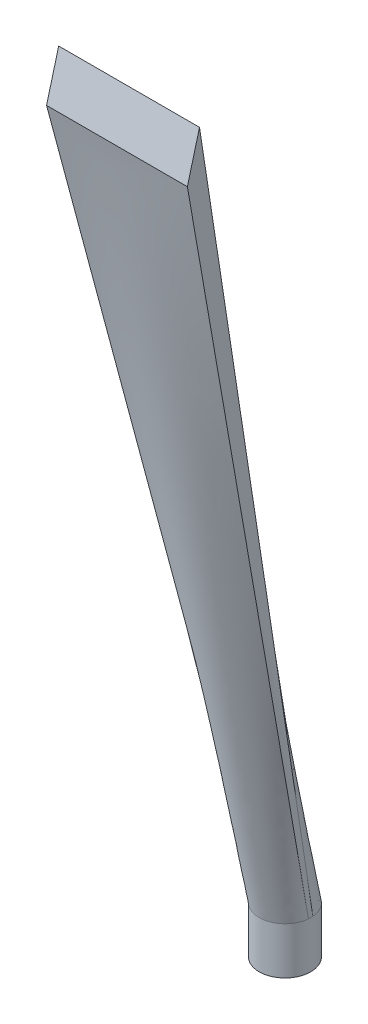
ISO-10303-21;
HEADER;
FILE_DESCRIPTION(('STEP AP214'),'2;1');
FILE_NAME('part.step','',(''),(''),'','','');
FILE_SCHEMA(('AUTOMOTIVE_DESIGN { 1 0 10303 214 1 1 1 1 }'));
ENDSEC;
DATA;
#1=APPLICATION_CONTEXT('core data for automotive mechanical design processes');
#2=APPLICATION_PROTOCOL_DEFINITION('international standard','automotive_design',2000,#1);
#3=PRODUCT_CONTEXT('',#1,'mechanical');
#4=PRODUCT('Part','Part','',(#3));
#5=PRODUCT_RELATED_PRODUCT_CATEGORY('part','',(#4));
#6=PRODUCT_DEFINITION_FORMATION('','',#4);
#7=PRODUCT_DEFINITION_CONTEXT('part definition',#1,'design');
#8=PRODUCT_DEFINITION('design','',#6,#7);
#9=PRODUCT_DEFINITION_SHAPE('','',#8);
#10=(LENGTH_UNIT() NAMED_UNIT(*) SI_UNIT(.MILLI.,.METRE.));
#11=(NAMED_UNIT(*) PLANE_ANGLE_UNIT() SI_UNIT($,.RADIAN.));
#12=(NAMED_UNIT(*) SI_UNIT($,.STERADIAN.) SOLID_ANGLE_UNIT());
#13=UNCERTAINTY_MEASURE_WITH_UNIT(LENGTH_MEASURE(1.E-05),#10,'distance_accuracy_value','');
#14=(GEOMETRIC_REPRESENTATION_CONTEXT(3) GLOBAL_UNCERTAINTY_ASSIGNED_CONTEXT((#13)) GLOBAL_UNIT_ASSIGNED_CONTEXT((#10,
#11,#12)) REPRESENTATION_CONTEXT('',''));
#15=CARTESIAN_POINT('',(0.,0.,0.));
#16=DIRECTION('',(0.,0.,1.));
#17=DIRECTION('',(1.,0.,0.));
#18=AXIS2_PLACEMENT_3D('',#15,#16,#17);
#19=CARTESIAN_POINT('',(0.,10.,0.));
#20=DIRECTION('',(0.,-1.,0.));
#21=DIRECTION('',(0.,0.,-1.));
#22=AXIS2_PLACEMENT_3D('',#19,#20,#21);
#23=CYLINDRICAL_SURFACE('',#22,5.5);
#24=CARTESIAN_POINT('',(0.,6.4,-5.5));
#25=CARTESIAN_POINT('',(-0.0773048842445591,6.39999791535494,-5.49999872545973));
#26=CARTESIAN_POINT('',(-0.154632790524441,6.39357557336227,-5.49835398423854));
#27=CARTESIAN_POINT('',(-0.307069339826278,6.36809622992761,-5.49195225148275));
#28=CARTESIAN_POINT('',(-0.382176752599211,6.34903235666165,-5.48719356725498));
#29=CARTESIAN_POINT('',(-0.527949238671479,6.29892358874975,-5.47509044111013));
#30=CARTESIAN_POINT('',(-0.598619629483061,6.26789336657137,-5.46774916678424));
#31=CARTESIAN_POINT('',(-0.733752228643042,6.19478510043921,-5.45126110120801));
#32=CARTESIAN_POINT('',(-0.798214172040278,6.15270658527472,-5.44211423295304));
#33=CARTESIAN_POINT('',(-0.920472473416103,6.05775000830458,-5.42278879332577));
#34=CARTESIAN_POINT('',(-0.978117819189877,6.00468084141597,-5.41259383960777));
#35=CARTESIAN_POINT('',(-1.08379364689064,5.88965838540526,-5.39242911774802));
#36=CARTESIAN_POINT('',(-1.13182300394015,5.82770405835117,-5.38245937607244));
#37=CARTESIAN_POINT('',(-1.21762063850407,5.69548863472367,-5.36370809078532));
#38=CARTESIAN_POINT('',(-1.25521870943935,5.62511387394251,-5.35494731115724));
#39=CARTESIAN_POINT('',(-1.31799146856049,5.47878348575326,-5.33984531832755));
#40=CARTESIAN_POINT('',(-1.34316822331491,5.40282878911198,-5.33350370268283));
#41=CARTESIAN_POINT('',(-1.37986602205555,5.2491583610413,-5.32412663932922));
#42=CARTESIAN_POINT('',(-1.39165920241181,5.17151172656839,-5.32102541066155));
#43=CARTESIAN_POINT('',(-1.40210295789717,5.01528493386204,-5.31828344958581));
#44=CARTESIAN_POINT('',(-1.4007557549539,4.93670493569682,-5.31864213213591));
#45=CARTESIAN_POINT('',(-1.38517382362171,4.78293786069106,-5.32272040476485));
#46=CARTESIAN_POINT('',(-1.37126470078388,4.70771518299115,-5.3263550762696));
#47=CARTESIAN_POINT('',(-1.33147372735175,4.56070776073046,-5.33644028895657));
#48=CARTESIAN_POINT('',(-1.30559099598359,4.48892326951006,-5.3428910372863));
#49=CARTESIAN_POINT('',(-1.24231330626715,4.34996333697399,-5.35795863283836));
#50=CARTESIAN_POINT('',(-1.20480125485013,4.28284368597169,-5.36659734039847));
#51=CARTESIAN_POINT('',(-1.1194115900729,4.15573559804708,-5.38505530705682));
#52=CARTESIAN_POINT('',(-1.07153210185643,4.09574845401707,-5.39487477954262));
#53=CARTESIAN_POINT('',(-0.965085886397212,3.98274374534973,-5.41494433468361));
#54=CARTESIAN_POINT('',(-0.906244742095388,3.929985071928,-5.42519855949331));
#55=CARTESIAN_POINT('',(-0.780426506291583,3.83503392147073,-5.44472048806602));
#56=CARTESIAN_POINT('',(-0.713449148092251,3.79284179093527,-5.45398815947206));
#57=CARTESIAN_POINT('',(-0.572881938789181,3.72012133629365,-5.47054168642758));
#58=CARTESIAN_POINT('',(-0.499268744723176,3.68963634208855,-5.4778201515144));
#59=CARTESIAN_POINT('',(-0.34773560315723,3.64154675976206,-5.48952153364639));
#60=CARTESIAN_POINT('',(-0.269816513933574,3.62393961464127,-5.49394501755027));
#61=CARTESIAN_POINT('',(-0.11409581038144,3.60250387238443,-5.49935365302411));
#62=CARTESIAN_POINT('',(-0.0363456876256445,3.59832287361052,-5.50042672290478));
#63=CARTESIAN_POINT('',(0.11874369704704,3.60288978751395,-5.49926466223468));
#64=CARTESIAN_POINT('',(0.19608299671977,3.61163649072017,-5.49702984115874));
#65=CARTESIAN_POINT('',(0.346921922039342,3.64152040671332,-5.48955956906865));
#66=CARTESIAN_POINT('',(0.42046239572951,3.66246421902601,-5.48437098196572));
#67=CARTESIAN_POINT('',(0.562981493503029,3.71592594785941,-5.47157891380273));
#68=CARTESIAN_POINT('',(0.631959646456293,3.74844505750246,-5.4639751838108));
#69=CARTESIAN_POINT('',(0.764789426404985,3.82480939317459,-5.44698690303916));
#70=CARTESIAN_POINT('',(0.828524522394591,3.86885048710791,-5.43757238521606));
#71=CARTESIAN_POINT('',(0.947824360643745,3.96675938020831,-5.41805217760614));
#72=CARTESIAN_POINT('',(1.0033876351497,4.02062894079807,-5.40794636413102));
#73=CARTESIAN_POINT('',(1.10622764496892,4.13830420158053,-5.38786418407469));
#74=CARTESIAN_POINT('',(1.15325677202767,4.20232835548851,-5.37789769964027));
#75=CARTESIAN_POINT('',(1.23590486774004,4.33756662802532,-5.3595091875876));
#76=CARTESIAN_POINT('',(1.2715243376448,4.40878043061638,-5.35108709212793));
#77=CARTESIAN_POINT('',(1.33007526262658,4.5559998996499,-5.33683503892478));
#78=CARTESIAN_POINT('',(1.35308171494095,4.63197418145127,-5.33098980077955));
#79=CARTESIAN_POINT('',(1.38594640154224,4.78688471815955,-5.3225413040893));
#80=CARTESIAN_POINT('',(1.39580763809809,4.86582029249359,-5.31993730527847));
#81=CARTESIAN_POINT('',(1.40194079646117,5.02188906453357,-5.31832400931396));
#82=CARTESIAN_POINT('',(1.39860904143414,5.09900584859978,-5.31920987108898));
#83=CARTESIAN_POINT('',(1.37936112086309,5.25153912341574,-5.3242332653694));
#84=CARTESIAN_POINT('',(1.36344522643773,5.32695565076063,-5.32837072782076));
#85=CARTESIAN_POINT('',(1.31970091487346,5.47349859660081,-5.33937162362339));
#86=CARTESIAN_POINT('',(1.29194940893323,5.54464938798325,-5.34621743690097));
#87=CARTESIAN_POINT('',(1.22538211014769,5.68133675534745,-5.36186558608171));
#88=CARTESIAN_POINT('',(1.18656472751624,5.74687252288257,-5.37066820307026));
#89=CARTESIAN_POINT('',(1.09773612733949,5.87237847220375,-5.38953489714849));
#90=CARTESIAN_POINT('',(1.04745111600293,5.93215074956052,-5.39962660429219));
#91=CARTESIAN_POINT('',(0.937644798813299,6.04253763332441,-5.41977237190905));
#92=CARTESIAN_POINT('',(0.87812129002087,6.09315004929192,-5.42982642281587));
#93=CARTESIAN_POINT('',(0.750165115842735,6.18471859288967,-5.44899174184822));
#94=CARTESIAN_POINT('',(0.681584890919074,6.22547337425833,-5.45808151269599));
#95=CARTESIAN_POINT('',(0.538320241252995,6.29481063340403,-5.4740651884717));
#96=CARTESIAN_POINT('',(0.463640113523221,6.32340159319865,-5.4809606226956));
#97=CARTESIAN_POINT('',(0.324275271985255,6.36349194568888,-5.49079310182131));
#98=CARTESIAN_POINT('',(0.260238280031033,6.37715229627942,-5.49422159263308));
#99=CARTESIAN_POINT('',(0.130806279374601,6.39540683792926,-5.49882548962657));
#100=CARTESIAN_POINT('',(0.0654113811916279,6.40000176391846,-5.50000107844983));
#101=CARTESIAN_POINT('',(0.,6.4,-5.5));
#102=B_SPLINE_CURVE_WITH_KNOTS('',3,(#24,#25,#26,#27,#28,#29,#30,#31,#32,#33,#34,#35,#36,#37,
#38,#39,#40,#41,#42,#43,#44,#45,#46,#47,#48,#49,#50,#51,#52,#53,#54,#55,#56,#57,#58,#59,#60,#61,
#62,#63,#64,#65,#66,#67,#68,#69,#70,#71,#72,#73,#74,#75,#76,#77,#78,#79,#80,#81,#82,#83,#84,#85,
#86,#87,#88,#89,#90,#91,#92,#93,#94,#95,#96,#97,#98,#99,#100,#101),.UNSPECIFIED.,.T.,.F.,(4,2,2,
2,2,2,2,2,2,2,2,2,2,2,2,2,2,2,2,2,2,2,2,2,2,2,2,2,2,2,2,2,2,2,2,2,2,2,4),(0.,0.23167489866669,
0.463475837097798,0.694993453271194,0.926520945296383,1.16247525755791,1.39845715562674,
1.63808915628129,1.87768127524435,2.11230906664584,2.3468971851611,2.57557396588813,
2.80426757066323,3.03534303563407,3.26646032344406,3.50441941512879,3.74238630899198,
3.98122565593394,4.22001756653907,4.45248828144497,4.68493724857071,4.91379709627019,
5.1426805405042,5.37574104384955,5.60884335656704,5.84789337265753,6.08693288531814,
6.32453520805198,6.56208325488996,6.79255020011164,7.02301218017953,7.25199883954841,
7.48101841302286,7.71621794363566,7.95147364448574,8.19119119169863,8.43074130515078,
8.62678847538596,8.82281975151176),.UNSPECIFIED.);
#103=CARTESIAN_POINT('',(0.,6.4,-5.5));
#104=VERTEX_POINT('',#103);
#105=EDGE_CURVE('E71',#104,#104,#102,.T.);
#106=ORIENTED_EDGE('',*,*,#105,.T.);
#107=EDGE_LOOP('',(#106));
#108=FACE_BOUND('',#107,.T.);
#109=CARTESIAN_POINT('',(5.47964521470163,10.,0.472745513989886));
#110=CARTESIAN_POINT('',(5.49318996142875,10.,0.315746865898593));
#111=CARTESIAN_POINT('',(5.49996233479231,10.,0.157873432949297));
#112=CARTESIAN_POINT('',(5.49996233479231,10.,-0.157873432949296));
#113=CARTESIAN_POINT('',(5.49318996142875,10.,-0.315746865898592));
#114=CARTESIAN_POINT('',(5.47964521470163,10.,-0.472745513989885));
#115=B_SPLINE_CURVE_WITH_KNOTS('',3,(#109,#110,#111,#112,#113,#114),.UNSPECIFIED.,.F.,.F.,(4,2,
4),(0.,0.5,1.),.UNSPECIFIED.);
#116=CARTESIAN_POINT('',(5.47967449872313,10.,0.472748031030865));
#117=VERTEX_POINT('',#116);
#118=CARTESIAN_POINT('',(5.47967779796221,10.,-0.472748324093858));
#119=VERTEX_POINT('',#118);
#120=EDGE_CURVE('E12',#117,#119,#115,.T.);
#121=ORIENTED_EDGE('',*,*,#120,.F.);
#122=CARTESIAN_POINT('',(-5.47964521478316,10.,0.472745513044765));
#123=CARTESIAN_POINT('',(-5.47632108142356,9.99999679978424,0.511275835108957));
#124=CARTESIAN_POINT('',(-5.47259067632118,9.99990886382516,0.549769679482633));
#125=CARTESIAN_POINT('',(-5.46431888878591,9.99963739751081,0.626669509199673));
#126=CARTESIAN_POINT('',(-5.45977751299709,9.99945386793869,0.665075495260228));
#127=CARTESIAN_POINT('',(-5.44493966088937,9.99887071817457,0.780136583030333));
#128=CARTESIAN_POINT('',(-5.43342914111034,9.99843852247503,0.856638507967667));
#129=CARTESIAN_POINT('',(-5.40719279582342,9.99780458544022,1.00908280574337));
#130=CARTESIAN_POINT('',(-5.39246716386582,9.99760283023695,1.08502521198049));
#131=CARTESIAN_POINT('',(-5.35982611754325,9.99751354351383,1.23622212308921));
#132=CARTESIAN_POINT('',(-5.3419107168077,9.99762601065138,1.31147663089864));
#133=CARTESIAN_POINT('',(-5.30293624796288,9.99808230723533,1.46110936398652));
#134=CARTESIAN_POINT('',(-5.28187937850245,9.99842597545456,1.53548816318468));
#135=CARTESIAN_POINT('',(-5.23664894745753,9.99914600729073,1.68329450359772));
#136=CARTESIAN_POINT('',(-5.21247538911876,9.99952237087362,1.75672204580317));
#137=CARTESIAN_POINT('',(-5.17391168447356,9.99987186129662,1.86604704442009));
#138=CARTESIAN_POINT('',(-5.16067271554014,9.99995251466656,1.90235392090914));
#139=CARTESIAN_POINT('',(-5.13343340544411,10.0000253321986,1.97467834229471));
#140=CARTESIAN_POINT('',(-5.11943311356991,10.0000175020823,2.01069590574862));
#141=CARTESIAN_POINT('',(-5.07629717169248,10.0000500761054,2.11829629679316));
#142=CARTESIAN_POINT('',(-5.04602619320225,10.0001465433141,2.18942756843401));
#143=CARTESIAN_POINT('',(-4.98249843954448,10.0002742989821,2.33038367669442));
#144=CARTESIAN_POINT('',(-4.94924024495362,10.0003055562831,2.40020787299056));
#145=CARTESIAN_POINT('',(-4.87981346103366,10.0003148878992,2.5383853725274));
#146=CARTESIAN_POINT('',(-4.84364500319879,10.0002929646159,2.60673874204769));
#147=CARTESIAN_POINT('',(-4.73086396016454,10.0001754553424,2.80941701868243));
#148=CARTESIAN_POINT('',(-4.64996368291905,10.0000281411765,2.94138676036774));
#149=CARTESIAN_POINT('',(-4.47736527077207,9.99991557765522,3.19798341706568));
#150=CARTESIAN_POINT('',(-4.38567177448987,9.99995025036428,3.32261345217458));
#151=CARTESIAN_POINT('',(-4.24050904734166,9.9999735269754,3.50343653570117));
#152=CARTESIAN_POINT('',(-4.19083311348158,9.99997649327304,3.56270942397397));
#153=CARTESIAN_POINT('',(-4.08902300374838,10.0000361527831,3.67911235496659));
#154=CARTESIAN_POINT('',(-4.03688880746521,10.0000928464417,3.73624237988791));
#155=CARTESIAN_POINT('',(-3.93025794028769,10.0001812543533,3.84825316693594));
#156=CARTESIAN_POINT('',(-3.8757612364364,10.0002129682577,3.90313389766424));
#157=CARTESIAN_POINT('',(-3.76450251193314,10.000217616479,4.01054854828686));
#158=CARTESIAN_POINT('',(-3.70774051008048,10.0001905512837,4.06308248764911));
#159=CARTESIAN_POINT('',(-3.59207870106269,10.0001076467033,4.16568652635452));
#160=CARTESIAN_POINT('',(-3.53317989280711,10.0000518206062,4.21575775181708));
#161=CARTESIAN_POINT('',(-3.41332280800014,9.99999917113495,4.31337469103312));
#162=CARTESIAN_POINT('',(-3.35236447994982,10.0000023492373,4.36092034155723));
#163=CARTESIAN_POINT('',(-3.22847266623812,10.0001088310788,4.45341925119608));
#164=CARTESIAN_POINT('',(-3.16553837696959,10.000212176079,4.49837143391585));
#165=CARTESIAN_POINT('',(-3.03783635493756,10.0003488209821,4.58557825416528));
#166=CARTESIAN_POINT('',(-2.97306879441268,10.0003821274431,4.6278331439035));
#167=CARTESIAN_POINT('',(-2.84180823601481,10.0003681531084,4.70957576440772));
#168=CARTESIAN_POINT('',(-2.77531519673171,10.0003208703767,4.74906342867825));
#169=CARTESIAN_POINT('',(-2.64072050364956,10.0001826176758,4.82520193698879));
#170=CARTESIAN_POINT('',(-2.57261877828242,10.0000916457594,4.86185265450583));
#171=CARTESIAN_POINT('',(-2.43493457836889,9.99999920108432,4.93224808932608));
#172=CARTESIAN_POINT('',(-2.36535219433418,9.99999772287051,4.96599298362753));
#173=CARTESIAN_POINT('',(-2.22482804962624,10.0001263730274,5.03051867434333));
#174=CARTESIAN_POINT('',(-2.15388630414312,10.0002564999283,5.06129950385631));
#175=CARTESIAN_POINT('',(-2.01076584571504,10.0004470088138,5.11984348063575));
#176=CARTESIAN_POINT('',(-1.93858712755366,10.0005073905042,5.1476066151727));
#177=CARTESIAN_POINT('',(-1.79313046051186,10.0005261267829,5.20006383971436));
#178=CARTESIAN_POINT('',(-1.71985250839089,10.0004844810703,5.22475792066947));
#179=CARTESIAN_POINT('',(-1.49855545049697,10.0002484541465,5.29416808506381));
#180=CARTESIAN_POINT('',(-1.34903279741705,9.99994302219855,5.33422858970762));
#181=CARTESIAN_POINT('',(-1.12268094645717,10.0000487818935,5.38475391729595));
#182=CARTESIAN_POINT('',(-1.04687718096714,10.0001780652513,5.40000261291051));
#183=CARTESIAN_POINT('',(-0.894686983255602,10.0004111168856,5.42729292181076));
#184=CARTESIAN_POINT('',(-0.818300550109251,10.0005148851217,5.43933453000486));
#185=CARTESIAN_POINT('',(-0.665087871173665,10.0006159772005,5.46018650496106));
#186=CARTESIAN_POINT('',(-0.588261614660053,10.0006132984366,5.46899679258892));
#187=CARTESIAN_POINT('',(-0.434305865244165,10.0005059748547,5.4833707938759));
#188=CARTESIAN_POINT('',(-0.357176373478369,10.0004013304185,5.48893451969099));
#189=CARTESIAN_POINT('',(-0.202752024686129,10.0001698609929,5.49680533654663));
#190=CARTESIAN_POINT('',(-0.12545716870314,10.0000430361432,5.49911244807621));
#191=CARTESIAN_POINT('',(0.0291625329465755,9.99998262541267,5.50046605944509));
#192=CARTESIAN_POINT('',(0.106487379099733,10.0000490428095,5.49951250397905));
#193=CARTESIAN_POINT('',(0.261030339366966,10.0002468685191,5.49434626929161));
#194=CARTESIAN_POINT('',(0.338248450130653,10.0003782788276,5.49013348999154));
#195=CARTESIAN_POINT('',(0.492433333318204,10.0005593501442,5.47845656409817));
#196=CARTESIAN_POINT('',(0.569400122365389,10.000609016673,5.47099263712376));
#197=CARTESIAN_POINT('',(0.722943337500415,10.0005953550904,5.4528275912485));
#198=CARTESIAN_POINT('',(0.799519799831031,10.0005320376688,5.44212677868061));
#199=CARTESIAN_POINT('',(0.952173061544569,10.0003279392039,5.41750360728579));
#200=CARTESIAN_POINT('',(1.02824972765972,10.000187138286,5.40358042244192));
#201=CARTESIAN_POINT('',(1.17973259713122,10.0000177005387,5.37254198098696));
#202=CARTESIAN_POINT('',(1.2551389380094,9.99998904014714,5.35542739572383));
#203=CARTESIAN_POINT('',(1.40517163762806,10.000079069043,5.31803257006204));
#204=CARTESIAN_POINT('',(1.47979790566529,10.0001977752775,5.29775196580747));
#205=CARTESIAN_POINT('',(1.62812892253155,10.0003948188098,5.25406260944803));
#206=CARTESIAN_POINT('',(1.70183367365883,10.0004731562083,5.23065386514639));
#207=CARTESIAN_POINT('',(1.84818273640836,10.0005337041884,5.18075254745355));
#208=CARTESIAN_POINT('',(1.92082716387727,10.0005159253512,5.15426031383347));
#209=CARTESIAN_POINT('',(2.06495008581217,10.0003849727012,5.09823107685491));
#210=CARTESIAN_POINT('',(2.13642832575367,10.0002717783401,5.06869341885174));
#211=CARTESIAN_POINT('',(2.27805772235552,10.000079549066,5.00663848294913));
#212=CARTESIAN_POINT('',(2.34820921452631,10.0000005054034,4.9741219708392));
#213=CARTESIAN_POINT('',(2.48708815282176,10.0000034575343,4.90615633341));
#214=CARTESIAN_POINT('',(2.55581541337022,10.0000854741821,4.87070682889144));
#215=CARTESIAN_POINT('',(2.6917140694425,10.0002387368557,4.79694202318275));
#216=CARTESIAN_POINT('',(2.75888547036451,10.0003099829187,4.75862673193767));
#217=CARTESIAN_POINT('',(2.89155419800347,10.0003840108679,4.67919778190737));
#218=CARTESIAN_POINT('',(2.95705150162634,10.0003867918101,4.63808408454693));
#219=CARTESIAN_POINT('',(3.08625339711822,10.0003061563537,4.55313269566294));
#220=CARTESIAN_POINT('',(3.14995801956846,10.0002227414264,4.509295050648));
#221=CARTESIAN_POINT('',(3.27546306890242,10.0000731797679,4.41897263327781));
#222=CARTESIAN_POINT('',(3.33726347952229,10.000007033184,4.37248783832292));
#223=CARTESIAN_POINT('',(3.45884986447758,9.99999443014489,4.2769539595914));
#224=CARTESIAN_POINT('',(3.5186358299138,10.0000479742183,4.22790486448891));
#225=CARTESIAN_POINT('',(3.63608416060515,10.0001429028947,4.12733192792407));
#226=CARTESIAN_POINT('',(3.69374662172397,10.0001842880473,4.07580819841941));
#227=CARTESIAN_POINT('',(3.80684784703988,10.0002228031358,3.97037615288328));
#228=CARTESIAN_POINT('',(3.86228661385904,10.0002199331239,3.91646783966374));
#229=CARTESIAN_POINT('',(3.97084284462793,10.0001525188698,3.80636084460762));
#230=CARTESIAN_POINT('',(4.02396032882185,10.0000879751655,3.75016218275371));
#231=CARTESIAN_POINT('',(4.12777487524444,10.0000140774806,3.63558173121919));
#232=CARTESIAN_POINT('',(4.17847193695013,10.0000047235119,3.57719994106689));
#233=CARTESIAN_POINT('',(4.32681598501275,9.99995912105342,3.39890461681422));
#234=CARTESIAN_POINT('',(4.42072749213865,9.99990533376509,3.27582930276119));
#235=CARTESIAN_POINT('',(4.553533947484,9.99995654612981,3.08566322932432));
#236=CARTESIAN_POINT('',(4.59646436542105,9.99999561281832,3.02134028019844));
#237=CARTESIAN_POINT('',(4.67957949240753,10.0000916397916,2.89093596061263));
#238=CARTESIAN_POINT('',(4.71976420891978,10.0001486000277,2.82485459493275));
#239=CARTESIAN_POINT('',(4.79730529237204,10.0002470120281,2.69106673403807));
#240=CARTESIAN_POINT('',(4.83466204118206,10.0002884658892,2.62336045987215));
#241=CARTESIAN_POINT('',(4.90648847935125,10.0003193087216,2.48643273910479));
#242=CARTESIAN_POINT('',(4.94095813874446,10.0003086971525,2.41721127678617));
#243=CARTESIAN_POINT('',(5.00694519183538,10.0002327265916,2.27738341558464));
#244=CARTESIAN_POINT('',(5.03846296184272,10.0001673745888,2.20677719462376));
#245=CARTESIAN_POINT('',(5.08348418410674,10.000065243795,2.09992445587947));
#246=CARTESIAN_POINT('',(5.09811548687545,10.0000305160335,2.06414928168602));
#247=CARTESIAN_POINT('',(5.12662074495777,10.0000050282885,1.9922985473187));
#248=CARTESIAN_POINT('',(5.14049470502788,10.0000142680289,1.95622298903302));
#249=CARTESIAN_POINT('',(5.17564080790401,9.99989683656268,1.86187787432744));
#250=CARTESIAN_POINT('',(5.19631176873768,9.99968457502079,1.80338291445589));
#251=CARTESIAN_POINT('',(5.23566133188262,9.99916665315106,1.68573405518732));
#252=CARTESIAN_POINT('',(5.25433998798084,9.99886099534552,1.62658017362709));
#253=CARTESIAN_POINT('',(5.3073531958664,9.99802717466736,1.44823250117271));
#254=CARTESIAN_POINT('',(5.33867697883244,9.99758194967861,1.32812048809131));
#255=CARTESIAN_POINT('',(5.37950107943261,9.99753353917306,1.14665276272477));
#256=CARTESIAN_POINT('',(5.39207897925917,9.99762050650957,1.08596759103763));
#257=CARTESIAN_POINT('',(5.41517775222457,9.99797054464012,0.964203606641484));
#258=CARTESIAN_POINT('',(5.42569862034607,9.9982336158637,0.903124792972714));
#259=CARTESIAN_POINT('',(5.44467154151399,9.99884930071134,0.780636634424086));
#260=CARTESIAN_POINT('',(5.4531232154659,9.99920193071928,0.719227231080328));
#261=CARTESIAN_POINT('',(5.46794646562669,9.99976526712189,0.596157511387007));
#262=CARTESIAN_POINT('',(5.4743180479698,9.99997597393511,0.534497195777932));
#263=CARTESIAN_POINT('',(5.47964521550487,10.,0.472745504679408));
#264=B_SPLINE_CURVE_WITH_KNOTS('',3,(#122,#123,#124,#125,#126,#127,#128,#129,#130,#131,#132,
#133,#134,#135,#136,#137,#138,#139,#140,#141,#142,#143,#144,#145,#146,#147,#148,#149,#150,#151,
#152,#153,#154,#155,#156,#157,#158,#159,#160,#161,#162,#163,#164,#165,#166,#167,#168,#169,#170,
#171,#172,#173,#174,#175,#176,#177,#178,#179,#180,#181,#182,#183,#184,#185,#186,#187,#188,#189,
#190,#191,#192,#193,#194,#195,#196,#197,#198,#199,#200,#201,#202,#203,#204,#205,#206,#207,#208,
#209,#210,#211,#212,#213,#214,#215,#216,#217,#218,#219,#220,#221,#222,#223,#224,#225,#226,#227,
#228,#229,#230,#231,#232,#233,#234,#235,#236,#237,#238,#239,#240,#241,#242,#243,#244,#245,#246,
#247,#248,#249,#250,#251,#252,#253,#254,#255,#256,#257,#258,#259,#260,#261,#262,#263),
.UNSPECIFIED.,.F.,.F.,(4,2,2,2,2,2,2,2,2,2,2,2,2,2,2,2,2,2,2,2,2,2,2,2,2,2,2,2,2,2,2,2,2,2,2,2,
2,2,2,2,2,2,2,2,2,2,2,2,2,2,2,2,2,2,2,2,2,2,2,2,2,2,2,2,2,2,2,2,2,2,4),(0.,0.116015419009212,
0.232029887577122,0.464047711519327,0.696051571799628,0.928054440786121,1.15989569096041,
1.3917366996961,1.50766535990971,1.62358652376066,1.85542648858687,2.08737720461893,
2.31931744631581,2.78311045857129,3.24670486854952,3.47865774618316,3.71061254997512,
3.94257059057422,4.17452670659484,4.40637575124072,4.63823059764088,4.87018099106614,
5.10210966426159,5.33404390871342,5.56598849108322,5.79791893533666,6.02984678940803,
6.26177562178045,6.49370513801569,6.95743379690003,7.18934946183052,7.42126549495029,
7.65318720725705,7.88510805118286,8.11702743596972,8.34895075444449,8.58088119470688,
8.81279597022097,9.0446888046055,9.27664114793758,9.50854475234704,9.74047502801326,
9.97240472513458,10.2043088899665,10.4362630092848,10.6681576653929,10.9000823495736,
11.1320062289504,11.3639333059793,11.5958564241798,11.8277815226849,12.0597076456295,
12.2916232856112,12.5235386521217,12.7554519956673,12.9873653893222,13.4511425084445,
13.6830915056635,13.9150398724207,14.1469568623316,14.3788762590792,14.6107660501668,
14.7267132492754,14.8426597200911,15.0287398033567,15.2148148616808,15.5868621095767,
15.7727603704993,15.9586590848435,16.1445918320177,16.3305240308673),.UNSPECIFIED.);
#265=CARTESIAN_POINT('',(-5.47967779796221,10.,0.472748324093855));
#266=VERTEX_POINT('',#265);
#267=EDGE_CURVE('E87',#266,#117,#264,.T.);
#268=ORIENTED_EDGE('',*,*,#267,.F.);
#269=CARTESIAN_POINT('',(0.,10.,0.));
#270=DIRECTION('',(0.,1.,0.));
#271=DIRECTION('',(0.,0.,1.));
#272=AXIS2_PLACEMENT_3D('',#269,#270,#271);
#273=CIRCLE('',#272,5.5);
#274=CARTESIAN_POINT('',(-5.47967449872313,10.,-0.472748031030872));
#275=VERTEX_POINT('',#274);
#276=EDGE_CURVE('E91',#275,#266,#273,.T.);
#277=ORIENTED_EDGE('',*,*,#276,.F.);
#278=EDGE_CURVE('E111',#119,#275,#273,.T.);
#279=ORIENTED_EDGE('',*,*,#278,.F.);
#280=EDGE_LOOP('',(#121,#268,#277,#279));
#281=FACE_BOUND('',#280,.T.);
#282=CARTESIAN_POINT('',(0.,0.,0.));
#283=DIRECTION('',(0.,1.,0.));
#284=DIRECTION('',(0.,0.,1.));
#285=AXIS2_PLACEMENT_3D('',#282,#283,#284);
#286=CIRCLE('',#285,5.5);
#287=CARTESIAN_POINT('',(0.,0.,5.5));
#288=VERTEX_POINT('',#287);
#289=EDGE_CURVE('E80',#288,#288,#286,.T.);
#290=ORIENTED_EDGE('',*,*,#289,.T.);
#291=EDGE_LOOP('',(#290));
#292=FACE_BOUND('',#291,.T.);
#293=ADVANCED_FACE('F67',(#108,#281,#292),#23,.T.);
#294=CARTESIAN_POINT('',(0.,0.,0.));
#295=DIRECTION('',(0.,1.,0.));
#296=DIRECTION('',(0.,0.,1.));
#297=AXIS2_PLACEMENT_3D('',#294,#295,#296);
#298=PLANE('',#297);
#299=ORIENTED_EDGE('',*,*,#289,.F.);
#300=EDGE_LOOP('',(#299));
#301=FACE_BOUND('',#300,.T.);
#302=ADVANCED_FACE('F218',(#301),#298,.F.);
#303=CARTESIAN_POINT('',(0.,20.1695909558946,75.2739382152813));
#304=DIRECTION('',(0.,0.258819045102518,0.965925826289069));
#305=DIRECTION('',(0.,-0.965925826289069,0.258819045102518));
#306=AXIS2_PLACEMENT_3D('',#303,#304,#305);
#307=PLANE('',#306);
#308=DIRECTION('',(-1.,0.,0.));
#309=VECTOR('',#308,1.);
#310=CARTESIAN_POINT('',(-15.,177.169629131445,33.2059047744875));
#311=LINE('',#310,#309);
#312=CARTESIAN_POINT('',(15.,177.169629131445,33.2059047744875));
#313=VERTEX_POINT('',#312);
#314=CARTESIAN_POINT('',(-15.,177.169629131445,33.2059047744875));
#315=VERTEX_POINT('',#314);
#316=EDGE_CURVE('E135',#313,#315,#311,.T.);
#317=ORIENTED_EDGE('',*,*,#316,.T.);
#318=DIRECTION('',(0.,-0.965925826289069,0.258819045102518));
#319=VECTOR('',#318,1.);
#320=CARTESIAN_POINT('',(-15.,167.510370868555,35.7940952255127));
#321=LINE('',#320,#319);
#322=CARTESIAN_POINT('',(-15.,167.510370868555,35.7940952255127));
#323=VERTEX_POINT('',#322);
#324=EDGE_CURVE('E152',#315,#323,#321,.T.);
#325=ORIENTED_EDGE('',*,*,#324,.T.);
#326=DIRECTION('',(1.,0.,0.));
#327=VECTOR('',#326,1.);
#328=CARTESIAN_POINT('',(-15.,167.510370868555,35.7940952255127));
#329=LINE('',#328,#327);
#330=CARTESIAN_POINT('',(15.,167.510370868555,35.7940952255127));
#331=VERTEX_POINT('',#330);
#332=EDGE_CURVE('E200',#323,#331,#329,.T.);
#333=ORIENTED_EDGE('',*,*,#332,.T.);
#334=DIRECTION('',(0.,0.965925826289069,-0.258819045102518));
#335=VECTOR('',#334,1.);
#336=CARTESIAN_POINT('',(15.,167.510370868555,35.7940952255127));
#337=LINE('',#336,#335);
#338=EDGE_CURVE('E131',#331,#313,#337,.T.);
#339=ORIENTED_EDGE('',*,*,#338,.T.);
#340=EDGE_LOOP('',(#317,#325,#333,#339));
#341=FACE_BOUND('',#340,.T.);
#342=ADVANCED_FACE('F169',(#341),#307,.T.);
#343=CARTESIAN_POINT('',(-5.47964521470163,10.,-0.472745513989888));
#344=CARTESIAN_POINT('',(-15.,177.169629131445,33.2059047744875));
#345=CARTESIAN_POINT('',(-5.49318996142875,10.,-0.315746865898594));
#346=CARTESIAN_POINT('',(-15.,175.559752754297,33.6372698496584));
#347=CARTESIAN_POINT('',(-5.49996233479231,10.,-0.157873432949298));
#348=CARTESIAN_POINT('',(-15.,173.949876377148,34.0686349248292));
#349=CARTESIAN_POINT('',(-5.49996233479231,10.,0.157873432949296));
#350=CARTESIAN_POINT('',(-15.,170.730123622851,34.931365075171));
#351=CARTESIAN_POINT('',(-5.49318996142875,10.,0.315746865898592));
#352=CARTESIAN_POINT('',(-15.,169.120247245703,35.3627301503418));
#353=CARTESIAN_POINT('',(-5.47964521470163,10.,0.472745513989886));
#354=CARTESIAN_POINT('',(-15.,167.510370868555,35.7940952255127));
#355=B_SPLINE_SURFACE_WITH_KNOTS('',3,1,((#343,#344),(#345,#346),(#347,#348),(#349,#350),(#351,
#352),(#353,#354)),.UNSPECIFIED.,.F.,.F.,.F.,(4,2,4),(2,2),(0.,0.5,1.),(0.,1.),.UNSPECIFIED.);
#356=DIRECTION('',(-0.0588756826728951,0.974074057331091,0.218433936979461));
#357=VECTOR('',#356,1.);
#358=CARTESIAN_POINT('',(-10.2398226073508,88.7551854342774,18.1334203697513));
#359=LINE('',#358,#357);
#360=EDGE_CURVE('E127',#266,#323,#359,.T.);
#361=DIRECTION('',(0.0557417563950411,-0.978779567971988,-0.197188777354504));
#362=VECTOR('',#361,1.);
#363=CARTESIAN_POINT('',(-10.2398226073508,93.5848145657227,16.3665796302488));
#364=LINE('',#363,#362);
#365=EDGE_CURVE('E137',#315,#275,#364,.T.);
#366=ORIENTED_EDGE('',*,*,#276,.T.);
#367=ORIENTED_EDGE('',*,*,#360,.T.);
#368=ORIENTED_EDGE('',*,*,#324,.F.);
#369=ORIENTED_EDGE('',*,*,#365,.T.);
#370=EDGE_LOOP('',(#366,#367,#368,#369));
#371=FACE_BOUND('',#370,.T.);
#372=ADVANCED_FACE('F158',(#371),#355,.T.);
#373=CARTESIAN_POINT('',(-5.38444166684864,8.42489629131445,0.119532016874658));
#374=CARTESIAN_POINT('',(-5.47964521470163,10.,0.472745513989886));
#375=CARTESIAN_POINT('',(-15.,167.510370868555,35.7940952255127));
#376=CARTESIAN_POINT('',(-5.35729950820559,8.42489629131445,0.579028634992725));
#377=CARTESIAN_POINT('',(-5.4403955526788,10.,0.927692660641438));
#378=CARTESIAN_POINT('',(-13.75,167.510370868555,35.7940952255127));
#379=CARTESIAN_POINT('',(-5.26920161214688,8.42489629131445,1.08875449092422));
#380=CARTESIAN_POINT('',(-5.34079367539296,10.,1.43237172592015));
#381=CARTESIAN_POINT('',(-12.5,167.510370868555,35.7940952255127));
#382=CARTESIAN_POINT('',(-4.88219713927357,8.42489629131445,2.16555868182811));
#383=CARTESIAN_POINT('',(-4.9328684547263,10.,2.49851448919133));
#384=CARTESIAN_POINT('',(-9.99999999999999,167.510370868555,35.7940952255127));
#385=CARTESIAN_POINT('',(-4.58066375582554,8.42489629131445,2.73377456527267));
#386=CARTESIAN_POINT('',(-4.62194431269855,10.,3.0611044727998));
#387=CARTESIAN_POINT('',(-8.75,167.510370868555,35.7940952255127));
#388=CARTESIAN_POINT('',(-3.91278749745754,8.42489629131445,3.53159530923812));
#389=CARTESIAN_POINT('',(-3.94211633411638,10.,3.85102600147846));
#390=CARTESIAN_POINT('',(-6.875,167.510370868555,35.7940952255127));
#391=CARTESIAN_POINT('',(-3.65461969674808,8.42489629131445,3.78756944202117));
#392=CARTESIAN_POINT('',(-3.68031653143374,10.,4.10446573690723));
#393=CARTESIAN_POINT('',(-6.25,167.510370868555,35.7940952255127));
#394=CARTESIAN_POINT('',(-3.06838519738734,8.42489629131445,4.2548574423987));
#395=CARTESIAN_POINT('',(-3.0875100964231,10.,4.56712712341963));
#396=CARTESIAN_POINT('',(-5.,167.510370868555,35.7940952255127));
#397=CARTESIAN_POINT('',(-2.74023762724199,8.42489629131445,4.46598162063134));
#398=CARTESIAN_POINT('',(-2.7564233933089,10.,4.77616096325393));
#399=CARTESIAN_POINT('',(-4.375,167.510370868555,35.7940952255127));
#400=CARTESIAN_POINT('',(-2.02644783228287,8.42489629131445,4.81764555835973));
#401=CARTESIAN_POINT('',(-2.03732458641868,10.,5.12434307981669));
#402=CARTESIAN_POINT('',(-3.12499999999999,167.510370868555,35.7940952255127));
#403=CARTESIAN_POINT('',(-1.64086148429062,8.42489629131445,4.95794537744344));
#404=CARTESIAN_POINT('',(-1.64936780622834,10.,5.26325379178076));
#405=CARTESIAN_POINT('',(-2.49999999999999,167.510370868555,35.7940952255127));
#406=CARTESIAN_POINT('',(-0.83675489160254,8.42489629131446,5.1477386683011));
#407=CARTESIAN_POINT('',(-0.840846427329248,10.,5.45116794114478));
#408=CARTESIAN_POINT('',(-1.25,167.510370868555,35.7940952255127));
#409=CARTESIAN_POINT('',(-0.41844900841483,8.42489629131445,5.19705904774487));
#410=CARTESIAN_POINT('',(-0.420494067737456,10.,5.5));
#411=CARTESIAN_POINT('',(-0.624999999999998,167.510370868555,35.7940952255127));
#412=CARTESIAN_POINT('',(0.418449008414829,8.42489629131445,5.19705904774487));
#413=CARTESIAN_POINT('',(0.420494067737455,10.,5.5));
#414=CARTESIAN_POINT('',(0.625000000000002,167.510370868555,35.7940952255127));
#415=CARTESIAN_POINT('',(0.836754891602539,8.42489629131446,5.1477386683011));
#416=CARTESIAN_POINT('',(0.840846427329247,10.,5.45116794114478));
#417=CARTESIAN_POINT('',(1.25,167.510370868555,35.7940952255127));
#418=CARTESIAN_POINT('',(1.64086148429062,8.42489629131446,4.95794537744344));
#419=CARTESIAN_POINT('',(1.64936780622833,10.,5.26325379178076));
#420=CARTESIAN_POINT('',(2.50000000000001,167.510370868555,35.7940952255127));
#421=CARTESIAN_POINT('',(2.02644783228287,8.42489629131445,4.81764555835973));
#422=CARTESIAN_POINT('',(2.03732458641868,10.,5.12434307981669));
#423=CARTESIAN_POINT('',(3.12500000000001,167.510370868555,35.7940952255127));
#424=CARTESIAN_POINT('',(2.74023762724199,8.42489629131445,4.46598162063134));
#425=CARTESIAN_POINT('',(2.7564233933089,10.,4.77616096325393));
#426=CARTESIAN_POINT('',(4.37500000000001,167.510370868555,35.7940952255127));
#427=CARTESIAN_POINT('',(3.06838519738733,8.42489629131445,4.2548574423987));
#428=CARTESIAN_POINT('',(3.0875100964231,10.,4.56712712341963));
#429=CARTESIAN_POINT('',(5.00000000000001,167.510370868555,35.7940952255127));
#430=CARTESIAN_POINT('',(3.65461969674808,8.42489629131445,3.78756944202117));
#431=CARTESIAN_POINT('',(3.68031653143374,10.,4.10446573690723));
#432=CARTESIAN_POINT('',(6.25000000000001,167.510370868555,35.7940952255127));
#433=CARTESIAN_POINT('',(3.91278749745754,8.42489629131445,3.53159530923812));
#434=CARTESIAN_POINT('',(3.94211633411637,10.,3.85102600147847));
#435=CARTESIAN_POINT('',(6.87500000000001,167.510370868555,35.7940952255127));
#436=CARTESIAN_POINT('',(4.58066375582553,8.42489629131445,2.73377456527267));
#437=CARTESIAN_POINT('',(4.62194431269855,10.,3.0611044727998));
#438=CARTESIAN_POINT('',(8.75000000000001,167.510370868555,35.7940952255127));
#439=CARTESIAN_POINT('',(4.88219713927356,8.42489629131445,2.16555868182811));
#440=CARTESIAN_POINT('',(4.9328684547263,10.,2.49851448919133));
#441=CARTESIAN_POINT('',(10.,167.510370868555,35.7940952255127));
#442=CARTESIAN_POINT('',(5.26920161214689,8.42489629131445,1.08875449092423));
#443=CARTESIAN_POINT('',(5.34079367539296,10.,1.43237172592015));
#444=CARTESIAN_POINT('',(12.5,167.510370868555,35.7940952255127));
#445=CARTESIAN_POINT('',(5.35729950820559,8.42489629131445,0.579028634992727));
#446=CARTESIAN_POINT('',(5.44039555267881,10.,0.927692660641439));
#447=CARTESIAN_POINT('',(13.75,167.510370868555,35.7940952255127));
#448=CARTESIAN_POINT('',(5.38444166684864,8.42489629131445,0.119532016874659));
#449=CARTESIAN_POINT('',(5.47964521470163,10.,0.472745513989887));
#450=CARTESIAN_POINT('',(15.,167.510370868555,35.7940952255127));
#451=B_SPLINE_SURFACE_WITH_KNOTS('',3,1,((#373,#374,#375),(#376,#377,#378),(#379,#380,#381),
(#382,#383,#384),(#385,#386,#387),(#388,#389,#390),(#391,#392,#393),(#394,#395,#396),(#397,#398,
#399),(#400,#401,#402),(#403,#404,#405),(#406,#407,#408),(#409,#410,#411),(#412,#413,#414),
(#415,#416,#417),(#418,#419,#420),(#421,#422,#423),(#424,#425,#426),(#427,#428,#429),(#430,#431,
#432),(#433,#434,#435),(#436,#437,#438),(#439,#440,#441),(#442,#443,#444),(#445,#446,#447),
(#448,#449,#450)),.UNSPECIFIED.,.F.,.F.,.F.,(4,2,2,2,2,2,2,2,2,2,2,2,4),(2,1,2),(0.,0.125,0.25,
0.3125,0.375,0.4375,0.5,0.5625,0.625,0.6875,0.75,0.875,1.),(-0.01,0.,1.),.UNSPECIFIED.);
#452=DIRECTION('',(0.0588756826728952,0.974074057331091,0.218433936979461));
#453=VECTOR('',#452,1.);
#454=CARTESIAN_POINT('',(10.2398226073508,88.7551854342774,18.1334203697513));
#455=LINE('',#454,#453);
#456=EDGE_CURVE('E125',#117,#331,#455,.T.);
#457=ORIENTED_EDGE('',*,*,#267,.T.);
#458=ORIENTED_EDGE('',*,*,#456,.T.);
#459=ORIENTED_EDGE('',*,*,#332,.F.);
#460=ORIENTED_EDGE('',*,*,#360,.F.);
#461=EDGE_LOOP('',(#457,#458,#459,#460));
#462=FACE_BOUND('',#461,.T.);
#463=ADVANCED_FACE('F123',(#462),#451,.T.);
#464=CARTESIAN_POINT('',(5.47964521470163,10.,-0.472745513989885));
#465=CARTESIAN_POINT('',(15.,177.169629131445,33.2059047744875));
#466=CARTESIAN_POINT('',(5.4403955526788,10.,-0.927692660641437));
#467=CARTESIAN_POINT('',(13.75,177.169629131445,33.2059047744875));
#468=CARTESIAN_POINT('',(5.34079367539296,10.,-1.43237172592015));
#469=CARTESIAN_POINT('',(12.5,177.169629131445,33.2059047744875));
#470=CARTESIAN_POINT('',(4.9328684547263,10.,-2.49851448919133));
#471=CARTESIAN_POINT('',(10.,177.169629131445,33.2059047744875));
#472=CARTESIAN_POINT('',(4.62194431269855,10.,-3.0611044727998));
#473=CARTESIAN_POINT('',(8.75000000000001,177.169629131445,33.2059047744875));
#474=CARTESIAN_POINT('',(3.94211633411638,10.,-3.85102600147846));
#475=CARTESIAN_POINT('',(6.87500000000001,177.169629131445,33.2059047744875));
#476=CARTESIAN_POINT('',(3.68031653143374,10.,-4.10446573690723));
#477=CARTESIAN_POINT('',(6.25000000000001,177.169629131445,33.2059047744875));
#478=CARTESIAN_POINT('',(3.0875100964231,10.,-4.56712712341963));
#479=CARTESIAN_POINT('',(5.00000000000001,177.169629131445,33.2059047744875));
#480=CARTESIAN_POINT('',(2.7564233933089,10.,-4.77616096325393));
#481=CARTESIAN_POINT('',(4.37500000000001,177.169629131445,33.2059047744875));
#482=CARTESIAN_POINT('',(2.03732458641868,10.,-5.12434307981669));
#483=CARTESIAN_POINT('',(3.12500000000001,177.169629131445,33.2059047744875));
#484=CARTESIAN_POINT('',(1.64936780622834,10.,-5.26325379178076));
#485=CARTESIAN_POINT('',(2.50000000000001,177.169629131445,33.2059047744875));
#486=CARTESIAN_POINT('',(0.840846427329247,10.,-5.45116794114478));
#487=CARTESIAN_POINT('',(1.25000000000001,177.169629131445,33.2059047744875));
#488=CARTESIAN_POINT('',(0.420494067737457,10.,-5.5));
#489=CARTESIAN_POINT('',(0.625000000000014,177.169629131445,33.2059047744875));
#490=CARTESIAN_POINT('',(-0.420494067737454,10.,-5.5));
#491=CARTESIAN_POINT('',(-0.624999999999986,177.169629131445,33.2059047744875));
#492=CARTESIAN_POINT('',(-0.840846427329245,10.,-5.45116794114478));
#493=CARTESIAN_POINT('',(-1.24999999999999,177.169629131445,33.2059047744875));
#494=CARTESIAN_POINT('',(-1.64936780622833,10.,-5.26325379178076));
#495=CARTESIAN_POINT('',(-2.49999999999999,177.169629131445,33.2059047744875));
#496=CARTESIAN_POINT('',(-2.03732458641868,10.,-5.12434307981669));
#497=CARTESIAN_POINT('',(-3.12499999999999,177.169629131445,33.2059047744875));
#498=CARTESIAN_POINT('',(-2.7564233933089,10.,-4.77616096325393));
#499=CARTESIAN_POINT('',(-4.37499999999999,177.169629131445,33.2059047744875));
#500=CARTESIAN_POINT('',(-3.0875100964231,10.,-4.56712712341963));
#501=CARTESIAN_POINT('',(-4.99999999999999,177.169629131445,33.2059047744875));
#502=CARTESIAN_POINT('',(-3.68031653143374,10.,-4.10446573690723));
#503=CARTESIAN_POINT('',(-6.24999999999999,177.169629131445,33.2059047744875));
#504=CARTESIAN_POINT('',(-3.94211633411637,10.,-3.85102600147846));
#505=CARTESIAN_POINT('',(-6.87499999999999,177.169629131445,33.2059047744875));
#506=CARTESIAN_POINT('',(-4.62194431269855,10.,-3.0611044727998));
#507=CARTESIAN_POINT('',(-8.74999999999999,177.169629131445,33.2059047744875));
#508=CARTESIAN_POINT('',(-4.9328684547263,10.,-2.49851448919133));
#509=CARTESIAN_POINT('',(-9.99999999999999,177.169629131445,33.2059047744875));
#510=CARTESIAN_POINT('',(-5.34079367539296,10.,-1.43237172592015));
#511=CARTESIAN_POINT('',(-12.5,177.169629131445,33.2059047744875));
#512=CARTESIAN_POINT('',(-5.4403955526788,10.,-0.92769266064144));
#513=CARTESIAN_POINT('',(-13.75,177.169629131445,33.2059047744875));
#514=CARTESIAN_POINT('',(-5.47964521470163,10.,-0.472745513989888));
#515=CARTESIAN_POINT('',(-15.,177.169629131445,33.2059047744875));
#516=B_SPLINE_SURFACE_WITH_KNOTS('',3,1,((#464,#465),(#466,#467),(#468,#469),(#470,#471),(#472,
#473),(#474,#475),(#476,#477),(#478,#479),(#480,#481),(#482,#483),(#484,#485),(#486,#487),(#488,
#489),(#490,#491),(#492,#493),(#494,#495),(#496,#497),(#498,#499),(#500,#501),(#502,#503),(#504,
#505),(#506,#507),(#508,#509),(#510,#511),(#512,#513),(#514,#515)),.UNSPECIFIED.,.F.,.F.,.F.,(4,
2,2,2,2,2,2,2,2,2,2,2,4),(2,2),(0.,0.125,0.25,0.3125,0.375,0.4375,0.5,0.5625,0.625,0.6875,0.75,
0.875,1.),(0.,1.),.UNSPECIFIED.);
#517=DIRECTION('',(0.0557417563950411,0.978779567971988,0.197188777354504));
#518=VECTOR('',#517,1.);
#519=CARTESIAN_POINT('',(10.2398226073508,93.5848145657227,16.3665796302488));
#520=LINE('',#519,#518);
#521=EDGE_CURVE('E133',#119,#313,#520,.T.);
#522=ORIENTED_EDGE('',*,*,#278,.T.);
#523=ORIENTED_EDGE('',*,*,#365,.F.);
#524=ORIENTED_EDGE('',*,*,#316,.F.);
#525=ORIENTED_EDGE('',*,*,#521,.F.);
#526=EDGE_LOOP('',(#522,#523,#524,#525));
#527=FACE_BOUND('',#526,.T.);
#528=ADVANCED_FACE('F309',(#527),#516,.T.);
#529=CARTESIAN_POINT('',(5.47964521470163,10.,0.472745513989886));
#530=CARTESIAN_POINT('',(15.,167.510370868555,35.7940952255127));
#531=CARTESIAN_POINT('',(5.49318996142875,10.,0.315746865898593));
#532=CARTESIAN_POINT('',(15.,169.120247245703,35.3627301503418));
#533=CARTESIAN_POINT('',(5.49996233479231,10.,0.157873432949297));
#534=CARTESIAN_POINT('',(15.,170.730123622852,34.9313650751709));
#535=CARTESIAN_POINT('',(5.49996233479231,10.,-0.157873432949296));
#536=CARTESIAN_POINT('',(15.,173.949876377148,34.0686349248292));
#537=CARTESIAN_POINT('',(5.49318996142875,10.,-0.315746865898592));
#538=CARTESIAN_POINT('',(15.,175.559752754297,33.6372698496583));
#539=CARTESIAN_POINT('',(5.47964521470163,10.,-0.472745513989885));
#540=CARTESIAN_POINT('',(15.,177.169629131445,33.2059047744875));
#541=B_SPLINE_SURFACE_WITH_KNOTS('',3,1,((#529,#530),(#531,#532),(#533,#534),(#535,#536),(#537,
#538),(#539,#540)),.UNSPECIFIED.,.F.,.F.,.F.,(4,2,4),(2,2),(0.,0.5,1.),(0.,1.),.UNSPECIFIED.);
#542=ORIENTED_EDGE('',*,*,#120,.T.);
#543=ORIENTED_EDGE('',*,*,#521,.T.);
#544=ORIENTED_EDGE('',*,*,#338,.F.);
#545=ORIENTED_EDGE('',*,*,#456,.F.);
#546=EDGE_LOOP('',(#542,#543,#544,#545));
#547=FACE_BOUND('',#546,.T.);
#548=ADVANCED_FACE('F130',(#547),#541,.T.);
#549=CARTESIAN_POINT('',(0.,5.,-5.50922558303823));
#550=DIRECTION('',(0.,0.,1.));
#551=DIRECTION('',(1.,0.,0.));
#552=AXIS2_PLACEMENT_3D('',#549,#550,#551);
#553=CYLINDRICAL_SURFACE('',#552,1.4);
#554=CARTESIAN_POINT('',(0.,5.,-1.));
#555=DIRECTION('',(0.,0.,1.));
#556=DIRECTION('',(1.,0.,0.));
#557=AXIS2_PLACEMENT_3D('',#554,#555,#556);
#558=CIRCLE('',#557,1.4);
#559=CARTESIAN_POINT('',(1.4,5.,-1.));
#560=VERTEX_POINT('',#559);
#561=EDGE_CURVE('E263',#560,#560,#558,.T.);
#562=ORIENTED_EDGE('',*,*,#561,.T.);
#563=EDGE_LOOP('',(#562));
#564=FACE_BOUND('',#563,.T.);
#565=ORIENTED_EDGE('',*,*,#105,.F.);
#566=EDGE_LOOP('',(#565));
#567=FACE_BOUND('',#566,.T.);
#568=ADVANCED_FACE('F170',(#564,#567),#553,.F.);
#569=CARTESIAN_POINT('',(0.,5.,-1.));
#570=DIRECTION('',(0.,0.,1.));
#571=DIRECTION('',(1.,0.,0.));
#572=AXIS2_PLACEMENT_3D('',#569,#570,#571);
#573=PLANE('',#572);
#574=ORIENTED_EDGE('',*,*,#561,.F.);
#575=EDGE_LOOP('',(#574));
#576=FACE_BOUND('',#575,.T.);
#577=ADVANCED_FACE('F387',(#576),#573,.F.);
#578=CLOSED_SHELL('',(#293,#302,#342,#372,#463,#528,#548,#568,#577));
#579=MANIFOLD_SOLID_BREP('B2',#578);
#580=ADVANCED_BREP_SHAPE_REPRESENTATION('',(#18,#579),#14);
#581=SHAPE_DEFINITION_REPRESENTATION(#9,#580);
ENDSEC;
END-ISO-10303-21;
